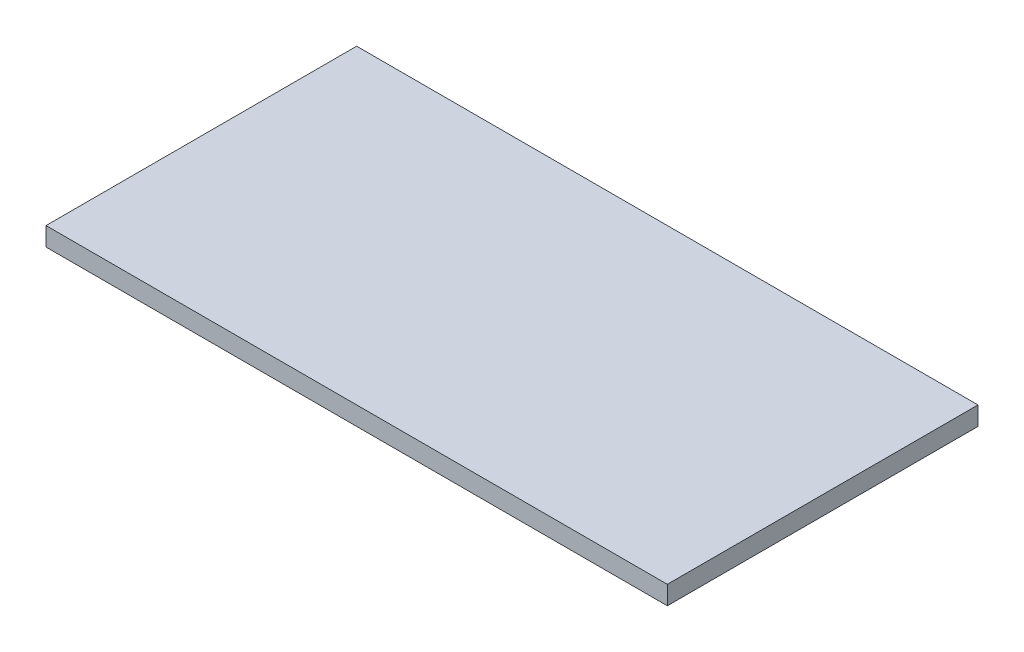
ISO-10303-21;
HEADER;
FILE_DESCRIPTION(('STEP AP214'),'2;1');
FILE_NAME('part.step','',(''),(''),'','','');
FILE_SCHEMA(('AUTOMOTIVE_DESIGN { 1 0 10303 214 1 1 1 1 }'));
ENDSEC;
DATA;
#1=APPLICATION_CONTEXT('core data for automotive mechanical design processes');
#2=APPLICATION_PROTOCOL_DEFINITION('international standard','automotive_design',2000,#1);
#3=PRODUCT_CONTEXT('',#1,'mechanical');
#4=PRODUCT('Part','Part','',(#3));
#5=PRODUCT_RELATED_PRODUCT_CATEGORY('part','',(#4));
#6=PRODUCT_DEFINITION_FORMATION('','',#4);
#7=PRODUCT_DEFINITION_CONTEXT('part definition',#1,'design');
#8=PRODUCT_DEFINITION('design','',#6,#7);
#9=PRODUCT_DEFINITION_SHAPE('','',#8);
#10=(LENGTH_UNIT() NAMED_UNIT(*) SI_UNIT(.MILLI.,.METRE.));
#11=(NAMED_UNIT(*) PLANE_ANGLE_UNIT() SI_UNIT($,.RADIAN.));
#12=(NAMED_UNIT(*) SI_UNIT($,.STERADIAN.) SOLID_ANGLE_UNIT());
#13=UNCERTAINTY_MEASURE_WITH_UNIT(LENGTH_MEASURE(1.E-05),#10,'distance_accuracy_value','');
#14=(GEOMETRIC_REPRESENTATION_CONTEXT(3) GLOBAL_UNCERTAINTY_ASSIGNED_CONTEXT((#13)) GLOBAL_UNIT_ASSIGNED_CONTEXT((#10,
#11,#12)) REPRESENTATION_CONTEXT('',''));
#15=CARTESIAN_POINT('',(0.,0.,0.));
#16=DIRECTION('',(0.,0.,1.));
#17=DIRECTION('',(1.,0.,0.));
#18=AXIS2_PLACEMENT_3D('',#15,#16,#17);
#19=CARTESIAN_POINT('',(500.,30.,-250.));
#20=DIRECTION('',(-1.,0.,0.));
#21=DIRECTION('',(0.,0.,1.));
#22=AXIS2_PLACEMENT_3D('',#19,#20,#21);
#23=PLANE('',#22);
#24=DIRECTION('',(0.,0.,-1.));
#25=VECTOR('',#24,1.);
#26=CARTESIAN_POINT('',(500.,0.,-250.));
#27=LINE('',#26,#25);
#28=CARTESIAN_POINT('',(500.,0.,250.));
#29=VERTEX_POINT('',#28);
#30=CARTESIAN_POINT('',(500.,0.,-250.));
#31=VERTEX_POINT('',#30);
#32=EDGE_CURVE('E111',#29,#31,#27,.T.);
#33=ORIENTED_EDGE('',*,*,#32,.T.);
#34=DIRECTION('',(0.,-1.,0.));
#35=VECTOR('',#34,1.);
#36=CARTESIAN_POINT('',(500.,30.,-250.));
#37=LINE('',#36,#35);
#38=CARTESIAN_POINT('',(500.,30.,-250.));
#39=VERTEX_POINT('',#38);
#40=EDGE_CURVE('E11',#39,#31,#37,.T.);
#41=ORIENTED_EDGE('',*,*,#40,.F.);
#42=DIRECTION('',(0.,0.,-1.));
#43=VECTOR('',#42,1.);
#44=CARTESIAN_POINT('',(500.,30.,-250.));
#45=LINE('',#44,#43);
#46=CARTESIAN_POINT('',(500.,30.,250.));
#47=VERTEX_POINT('',#46);
#48=EDGE_CURVE('E95',#47,#39,#45,.T.);
#49=ORIENTED_EDGE('',*,*,#48,.F.);
#50=DIRECTION('',(0.,-1.,0.));
#51=VECTOR('',#50,1.);
#52=CARTESIAN_POINT('',(500.,30.,250.));
#53=LINE('',#52,#51);
#54=EDGE_CURVE('E107',#47,#29,#53,.T.);
#55=ORIENTED_EDGE('',*,*,#54,.T.);
#56=EDGE_LOOP('',(#33,#41,#49,#55));
#57=FACE_BOUND('',#56,.T.);
#58=ADVANCED_FACE('F43',(#57),#23,.F.);
#59=CARTESIAN_POINT('',(-500.,30.,-250.));
#60=DIRECTION('',(0.,0.,1.));
#61=DIRECTION('',(1.,0.,0.));
#62=AXIS2_PLACEMENT_3D('',#59,#60,#61);
#63=PLANE('',#62);
#64=DIRECTION('',(-1.,0.,0.));
#65=VECTOR('',#64,1.);
#66=CARTESIAN_POINT('',(-500.,0.,-250.));
#67=LINE('',#66,#65);
#68=CARTESIAN_POINT('',(-500.,0.,-250.));
#69=VERTEX_POINT('',#68);
#70=EDGE_CURVE('E100',#31,#69,#67,.T.);
#71=ORIENTED_EDGE('',*,*,#70,.T.);
#72=DIRECTION('',(0.,-1.,0.));
#73=VECTOR('',#72,1.);
#74=CARTESIAN_POINT('',(-500.,30.,-250.));
#75=LINE('',#74,#73);
#76=CARTESIAN_POINT('',(-500.,30.,-250.));
#77=VERTEX_POINT('',#76);
#78=EDGE_CURVE('E52',#77,#69,#75,.T.);
#79=ORIENTED_EDGE('',*,*,#78,.F.);
#80=DIRECTION('',(-1.,0.,0.));
#81=VECTOR('',#80,1.);
#82=CARTESIAN_POINT('',(-500.,30.,-250.));
#83=LINE('',#82,#81);
#84=EDGE_CURVE('E90',#39,#77,#83,.T.);
#85=ORIENTED_EDGE('',*,*,#84,.F.);
#86=ORIENTED_EDGE('',*,*,#40,.T.);
#87=EDGE_LOOP('',(#71,#79,#85,#86));
#88=FACE_BOUND('',#87,.T.);
#89=ADVANCED_FACE('F99',(#88),#63,.F.);
#90=CARTESIAN_POINT('',(-500.,30.,-250.));
#91=DIRECTION('',(1.,0.,0.));
#92=DIRECTION('',(0.,0.,-1.));
#93=AXIS2_PLACEMENT_3D('',#90,#91,#92);
#94=PLANE('',#93);
#95=DIRECTION('',(0.,0.,1.));
#96=VECTOR('',#95,1.);
#97=CARTESIAN_POINT('',(-500.,0.,-250.));
#98=LINE('',#97,#96);
#99=CARTESIAN_POINT('',(-500.,0.,250.));
#100=VERTEX_POINT('',#99);
#101=EDGE_CURVE('E77',#69,#100,#98,.T.);
#102=ORIENTED_EDGE('',*,*,#101,.T.);
#103=DIRECTION('',(0.,-1.,0.));
#104=VECTOR('',#103,1.);
#105=CARTESIAN_POINT('',(-500.,30.,250.));
#106=LINE('',#105,#104);
#107=CARTESIAN_POINT('',(-500.,30.,250.));
#108=VERTEX_POINT('',#107);
#109=EDGE_CURVE('E102',#108,#100,#106,.T.);
#110=ORIENTED_EDGE('',*,*,#109,.F.);
#111=DIRECTION('',(0.,0.,1.));
#112=VECTOR('',#111,1.);
#113=CARTESIAN_POINT('',(-500.,30.,-250.));
#114=LINE('',#113,#112);
#115=EDGE_CURVE('E93',#77,#108,#114,.T.);
#116=ORIENTED_EDGE('',*,*,#115,.F.);
#117=ORIENTED_EDGE('',*,*,#78,.T.);
#118=EDGE_LOOP('',(#102,#110,#116,#117));
#119=FACE_BOUND('',#118,.T.);
#120=ADVANCED_FACE('F103',(#119),#94,.F.);
#121=CARTESIAN_POINT('',(-500.,30.,250.));
#122=DIRECTION('',(0.,0.,-1.));
#123=DIRECTION('',(-1.,0.,0.));
#124=AXIS2_PLACEMENT_3D('',#121,#122,#123);
#125=PLANE('',#124);
#126=DIRECTION('',(1.,0.,0.));
#127=VECTOR('',#126,1.);
#128=CARTESIAN_POINT('',(-500.,0.,250.));
#129=LINE('',#128,#127);
#130=EDGE_CURVE('E83',#100,#29,#129,.T.);
#131=ORIENTED_EDGE('',*,*,#130,.T.);
#132=ORIENTED_EDGE('',*,*,#54,.F.);
#133=DIRECTION('',(1.,0.,0.));
#134=VECTOR('',#133,1.);
#135=CARTESIAN_POINT('',(-500.,30.,250.));
#136=LINE('',#135,#134);
#137=EDGE_CURVE('E60',#108,#47,#136,.T.);
#138=ORIENTED_EDGE('',*,*,#137,.F.);
#139=ORIENTED_EDGE('',*,*,#109,.T.);
#140=EDGE_LOOP('',(#131,#132,#138,#139));
#141=FACE_BOUND('',#140,.T.);
#142=ADVANCED_FACE('F124',(#141),#125,.F.);
#143=CARTESIAN_POINT('',(0.,30.,0.));
#144=DIRECTION('',(0.,1.,0.));
#145=DIRECTION('',(0.,0.,1.));
#146=AXIS2_PLACEMENT_3D('',#143,#144,#145);
#147=PLANE('',#146);
#148=ORIENTED_EDGE('',*,*,#48,.T.);
#149=ORIENTED_EDGE('',*,*,#84,.T.);
#150=ORIENTED_EDGE('',*,*,#115,.T.);
#151=ORIENTED_EDGE('',*,*,#137,.T.);
#152=EDGE_LOOP('',(#148,#149,#150,#151));
#153=FACE_BOUND('',#152,.T.);
#154=ADVANCED_FACE('F91',(#153),#147,.T.);
#155=CARTESIAN_POINT('',(0.,0.,0.));
#156=DIRECTION('',(0.,1.,0.));
#157=DIRECTION('',(0.,0.,1.));
#158=AXIS2_PLACEMENT_3D('',#155,#156,#157);
#159=PLANE('',#158);
#160=ORIENTED_EDGE('',*,*,#32,.F.);
#161=ORIENTED_EDGE('',*,*,#130,.F.);
#162=ORIENTED_EDGE('',*,*,#101,.F.);
#163=ORIENTED_EDGE('',*,*,#70,.F.);
#164=EDGE_LOOP('',(#160,#161,#162,#163));
#165=FACE_BOUND('',#164,.T.);
#166=ADVANCED_FACE('F127',(#165),#159,.F.);
#167=CLOSED_SHELL('',(#58,#89,#120,#142,#154,#166));
#168=MANIFOLD_SOLID_BREP('B2',#167);
#169=ADVANCED_BREP_SHAPE_REPRESENTATION('',(#18,#168),#14);
#170=SHAPE_DEFINITION_REPRESENTATION(#9,#169);
ENDSEC;
END-ISO-10303-21;
